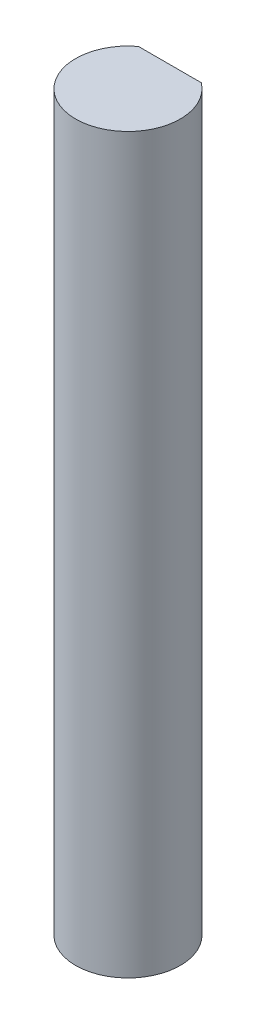
ISO-10303-21;
HEADER;
FILE_DESCRIPTION(('STEP AP214'),'2;1');
FILE_NAME('part.step','',(''),(''),'','','');
FILE_SCHEMA(('AUTOMOTIVE_DESIGN { 1 0 10303 214 1 1 1 1 }'));
ENDSEC;
DATA;
#1=APPLICATION_CONTEXT('core data for automotive mechanical design processes');
#2=APPLICATION_PROTOCOL_DEFINITION('international standard','automotive_design',2000,#1);
#3=PRODUCT_CONTEXT('',#1,'mechanical');
#4=PRODUCT('Part','Part','',(#3));
#5=PRODUCT_RELATED_PRODUCT_CATEGORY('part','',(#4));
#6=PRODUCT_DEFINITION_FORMATION('','',#4);
#7=PRODUCT_DEFINITION_CONTEXT('part definition',#1,'design');
#8=PRODUCT_DEFINITION('design','',#6,#7);
#9=PRODUCT_DEFINITION_SHAPE('','',#8);
#10=(LENGTH_UNIT() NAMED_UNIT(*) SI_UNIT(.MILLI.,.METRE.));
#11=(NAMED_UNIT(*) PLANE_ANGLE_UNIT() SI_UNIT($,.RADIAN.));
#12=(NAMED_UNIT(*) SI_UNIT($,.STERADIAN.) SOLID_ANGLE_UNIT());
#13=UNCERTAINTY_MEASURE_WITH_UNIT(LENGTH_MEASURE(1.E-05),#10,'distance_accuracy_value','');
#14=(GEOMETRIC_REPRESENTATION_CONTEXT(3) GLOBAL_UNCERTAINTY_ASSIGNED_CONTEXT((#13)) GLOBAL_UNIT_ASSIGNED_CONTEXT((#10,
#11,#12)) REPRESENTATION_CONTEXT('',''));
#15=CARTESIAN_POINT('',(0.,0.,0.));
#16=DIRECTION('',(0.,0.,1.));
#17=DIRECTION('',(1.,0.,0.));
#18=AXIS2_PLACEMENT_3D('',#15,#16,#17);
#19=CARTESIAN_POINT('',(0.,44.45,0.));
#20=DIRECTION('',(0.,-1.,0.));
#21=DIRECTION('',(0.,0.,-1.));
#22=AXIS2_PLACEMENT_3D('',#19,#20,#21);
#23=CYLINDRICAL_SURFACE('',#22,3.175);
#24=CARTESIAN_POINT('',(0.,0.,0.));
#25=DIRECTION('',(0.,1.,0.));
#26=DIRECTION('',(0.,0.,1.));
#27=AXIS2_PLACEMENT_3D('',#24,#25,#26);
#28=CIRCLE('',#27,3.175);
#29=CARTESIAN_POINT('',(-1.905,0.,-2.54));
#30=VERTEX_POINT('',#29);
#31=CARTESIAN_POINT('',(1.905,0.,-2.54));
#32=VERTEX_POINT('',#31);
#33=EDGE_CURVE('E64',#30,#32,#28,.T.);
#34=ORIENTED_EDGE('',*,*,#33,.T.);
#35=DIRECTION('',(0.,-1.,0.));
#36=VECTOR('',#35,1.);
#37=CARTESIAN_POINT('',(1.905,44.45,-2.54));
#38=LINE('',#37,#36);
#39=CARTESIAN_POINT('',(1.905,44.45,-2.54));
#40=VERTEX_POINT('',#39);
#41=EDGE_CURVE('E11',#40,#32,#38,.T.);
#42=ORIENTED_EDGE('',*,*,#41,.F.);
#43=CARTESIAN_POINT('',(0.,44.45,0.));
#44=DIRECTION('',(0.,1.,0.));
#45=DIRECTION('',(0.,0.,1.));
#46=AXIS2_PLACEMENT_3D('',#43,#44,#45);
#47=CIRCLE('',#46,3.175);
#48=CARTESIAN_POINT('',(-1.905,44.45,-2.54));
#49=VERTEX_POINT('',#48);
#50=EDGE_CURVE('E63',#49,#40,#47,.T.);
#51=ORIENTED_EDGE('',*,*,#50,.F.);
#52=DIRECTION('',(0.,-1.,0.));
#53=VECTOR('',#52,1.);
#54=CARTESIAN_POINT('',(-1.905,44.45,-2.54));
#55=LINE('',#54,#53);
#56=EDGE_CURVE('E41',#49,#30,#55,.T.);
#57=ORIENTED_EDGE('',*,*,#56,.T.);
#58=EDGE_LOOP('',(#34,#42,#51,#57));
#59=FACE_BOUND('',#58,.T.);
#60=ADVANCED_FACE('F33',(#59),#23,.T.);
#61=CARTESIAN_POINT('',(-1.905,44.45,-2.54));
#62=DIRECTION('',(0.,0.,1.));
#63=DIRECTION('',(1.,0.,0.));
#64=AXIS2_PLACEMENT_3D('',#61,#62,#63);
#65=PLANE('',#64);
#66=DIRECTION('',(-1.,0.,0.));
#67=VECTOR('',#66,1.);
#68=CARTESIAN_POINT('',(-1.905,0.,-2.54));
#69=LINE('',#68,#67);
#70=EDGE_CURVE('E56',#32,#30,#69,.T.);
#71=ORIENTED_EDGE('',*,*,#70,.T.);
#72=ORIENTED_EDGE('',*,*,#56,.F.);
#73=DIRECTION('',(-1.,0.,0.));
#74=VECTOR('',#73,1.);
#75=CARTESIAN_POINT('',(-1.905,44.45,-2.54));
#76=LINE('',#75,#74);
#77=EDGE_CURVE('E48',#40,#49,#76,.T.);
#78=ORIENTED_EDGE('',*,*,#77,.F.);
#79=ORIENTED_EDGE('',*,*,#41,.T.);
#80=EDGE_LOOP('',(#71,#72,#78,#79));
#81=FACE_BOUND('',#80,.T.);
#82=ADVANCED_FACE('F59',(#81),#65,.F.);
#83=CARTESIAN_POINT('',(0.,44.45,0.));
#84=DIRECTION('',(0.,1.,0.));
#85=DIRECTION('',(0.,0.,1.));
#86=AXIS2_PLACEMENT_3D('',#83,#84,#85);
#87=PLANE('',#86);
#88=ORIENTED_EDGE('',*,*,#50,.T.);
#89=ORIENTED_EDGE('',*,*,#77,.T.);
#90=EDGE_LOOP('',(#88,#89));
#91=FACE_BOUND('',#90,.T.);
#92=ADVANCED_FACE('F71',(#91),#87,.T.);
#93=CARTESIAN_POINT('',(0.,0.,0.));
#94=DIRECTION('',(0.,1.,0.));
#95=DIRECTION('',(0.,0.,1.));
#96=AXIS2_PLACEMENT_3D('',#93,#94,#95);
#97=PLANE('',#96);
#98=ORIENTED_EDGE('',*,*,#33,.F.);
#99=ORIENTED_EDGE('',*,*,#70,.F.);
#100=EDGE_LOOP('',(#98,#99));
#101=FACE_BOUND('',#100,.T.);
#102=ADVANCED_FACE('F67',(#101),#97,.F.);
#103=CLOSED_SHELL('',(#60,#82,#92,#102));
#104=MANIFOLD_SOLID_BREP('B2',#103);
#105=ADVANCED_BREP_SHAPE_REPRESENTATION('',(#18,#104),#14);
#106=SHAPE_DEFINITION_REPRESENTATION(#9,#105);
ENDSEC;
END-ISO-10303-21;
